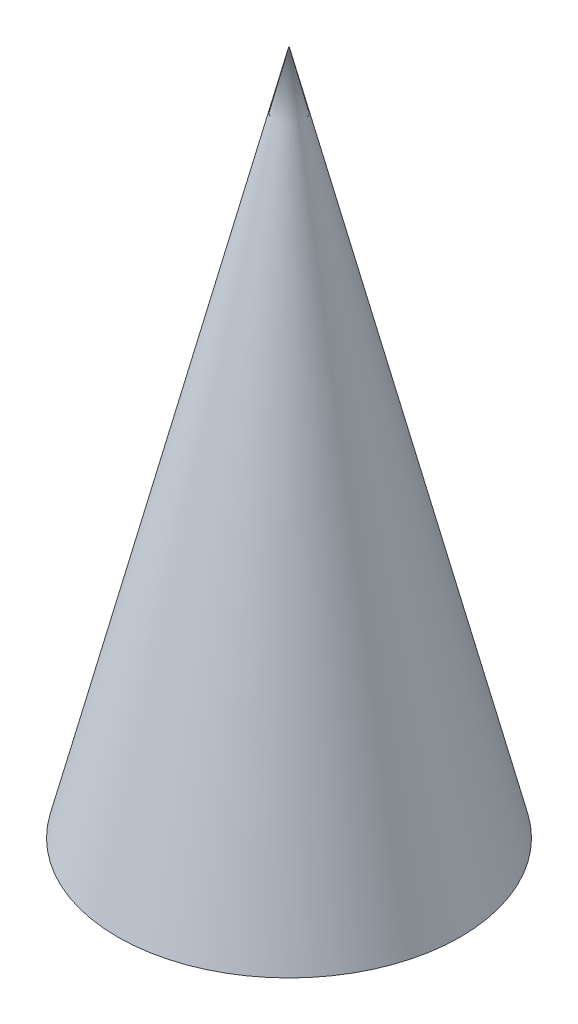
ISO-10303-21;
HEADER;
FILE_DESCRIPTION(('STEP AP214'),'2;1');
FILE_NAME('part.step','',(''),(''),'','','');
FILE_SCHEMA(('AUTOMOTIVE_DESIGN { 1 0 10303 214 1 1 1 1 }'));
ENDSEC;
DATA;
#1=APPLICATION_CONTEXT('core data for automotive mechanical design processes');
#2=APPLICATION_PROTOCOL_DEFINITION('international standard','automotive_design',2000,#1);
#3=PRODUCT_CONTEXT('',#1,'mechanical');
#4=PRODUCT('Part','Part','',(#3));
#5=PRODUCT_RELATED_PRODUCT_CATEGORY('part','',(#4));
#6=PRODUCT_DEFINITION_FORMATION('','',#4);
#7=PRODUCT_DEFINITION_CONTEXT('part definition',#1,'design');
#8=PRODUCT_DEFINITION('design','',#6,#7);
#9=PRODUCT_DEFINITION_SHAPE('','',#8);
#10=(LENGTH_UNIT() NAMED_UNIT(*) SI_UNIT(.MILLI.,.METRE.));
#11=(NAMED_UNIT(*) PLANE_ANGLE_UNIT() SI_UNIT($,.RADIAN.));
#12=(NAMED_UNIT(*) SI_UNIT($,.STERADIAN.) SOLID_ANGLE_UNIT());
#13=UNCERTAINTY_MEASURE_WITH_UNIT(LENGTH_MEASURE(1.E-05),#10,'distance_accuracy_value','');
#14=(GEOMETRIC_REPRESENTATION_CONTEXT(3) GLOBAL_UNCERTAINTY_ASSIGNED_CONTEXT((#13)) GLOBAL_UNIT_ASSIGNED_CONTEXT((#10,
#11,#12)) REPRESENTATION_CONTEXT('',''));
#15=CARTESIAN_POINT('',(0.,0.,0.));
#16=DIRECTION('',(0.,0.,1.));
#17=DIRECTION('',(1.,0.,0.));
#18=AXIS2_PLACEMENT_3D('',#15,#16,#17);
#19=CARTESIAN_POINT('',(0.,0.,0.));
#20=DIRECTION('',(0.,1.,0.));
#21=DIRECTION('',(0.,0.,1.));
#22=AXIS2_PLACEMENT_3D('',#19,#20,#21);
#23=PLANE('',#22);
#24=CARTESIAN_POINT('',(0.,0.,0.));
#25=DIRECTION('',(0.,1.,0.));
#26=DIRECTION('',(0.,0.,1.));
#27=AXIS2_PLACEMENT_3D('',#24,#25,#26);
#28=CIRCLE('',#27,5.);
#29=CARTESIAN_POINT('',(0.,0.,5.));
#30=VERTEX_POINT('',#29);
#31=EDGE_CURVE('E12',#30,#30,#28,.T.);
#32=ORIENTED_EDGE('',*,*,#31,.F.);
#33=EDGE_LOOP('',(#32));
#34=FACE_BOUND('',#33,.T.);
#35=ADVANCED_FACE('F31',(#34),#23,.F.);
#36=CARTESIAN_POINT('',(0.,20.,0.));
#37=DIRECTION('',(0.,-1.,0.));
#38=DIRECTION('',(0.,0.,-1.));
#39=AXIS2_PLACEMENT_3D('',#36,#37,#38);
#40=CONICAL_SURFACE('',#39,0.,0.244978663126864);
#41=ORIENTED_EDGE('',*,*,#31,.T.);
#42=EDGE_LOOP('',(#41));
#43=FACE_BOUND('',#42,.T.);
#44=CARTESIAN_POINT('',(0.,20.,0.));
#45=VERTEX_POINT('',#44);
#46=VERTEX_LOOP('',#45);
#47=FACE_BOUND('',#46,.T.);
#48=ADVANCED_FACE('F41',(#43,#47),#40,.T.);
#49=CLOSED_SHELL('',(#35,#48));
#50=MANIFOLD_SOLID_BREP('B2',#49);
#51=ADVANCED_BREP_SHAPE_REPRESENTATION('',(#18,#50),#14);
#52=SHAPE_DEFINITION_REPRESENTATION(#9,#51);
ENDSEC;
END-ISO-10303-21;
